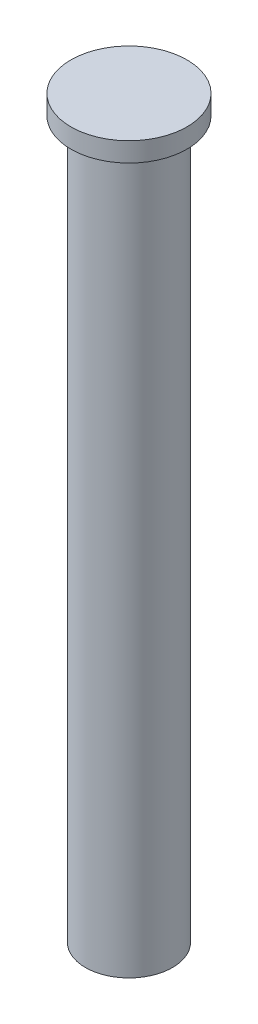
ISO-10303-21;
HEADER;
FILE_DESCRIPTION(('STEP AP214'),'2;1');
FILE_NAME('part.step','',(''),(''),'','','');
FILE_SCHEMA(('AUTOMOTIVE_DESIGN { 1 0 10303 214 1 1 1 1 }'));
ENDSEC;
DATA;
#1=APPLICATION_CONTEXT('core data for automotive mechanical design processes');
#2=APPLICATION_PROTOCOL_DEFINITION('international standard','automotive_design',2000,#1);
#3=PRODUCT_CONTEXT('',#1,'mechanical');
#4=PRODUCT('Part','Part','',(#3));
#5=PRODUCT_RELATED_PRODUCT_CATEGORY('part','',(#4));
#6=PRODUCT_DEFINITION_FORMATION('','',#4);
#7=PRODUCT_DEFINITION_CONTEXT('part definition',#1,'design');
#8=PRODUCT_DEFINITION('design','',#6,#7);
#9=PRODUCT_DEFINITION_SHAPE('','',#8);
#10=(LENGTH_UNIT() NAMED_UNIT(*) SI_UNIT(.MILLI.,.METRE.));
#11=(NAMED_UNIT(*) PLANE_ANGLE_UNIT() SI_UNIT($,.RADIAN.));
#12=(NAMED_UNIT(*) SI_UNIT($,.STERADIAN.) SOLID_ANGLE_UNIT());
#13=UNCERTAINTY_MEASURE_WITH_UNIT(LENGTH_MEASURE(1.E-05),#10,'distance_accuracy_value','');
#14=(GEOMETRIC_REPRESENTATION_CONTEXT(3) GLOBAL_UNCERTAINTY_ASSIGNED_CONTEXT((#13)) GLOBAL_UNIT_ASSIGNED_CONTEXT((#10,
#11,#12)) REPRESENTATION_CONTEXT('',''));
#15=CARTESIAN_POINT('',(0.,0.,0.));
#16=DIRECTION('',(0.,0.,1.));
#17=DIRECTION('',(1.,0.,0.));
#18=AXIS2_PLACEMENT_3D('',#15,#16,#17);
#19=CARTESIAN_POINT('',(0.,90.,0.));
#20=DIRECTION('',(0.,1.,0.));
#21=DIRECTION('',(-1.,0.,0.));
#22=AXIS2_PLACEMENT_3D('',#19,#20,#21);
#23=PLANE('',#22);
#24=CARTESIAN_POINT('',(0.,90.,0.));
#25=DIRECTION('',(0.,1.,0.));
#26=DIRECTION('',(-1.,0.,0.));
#27=AXIS2_PLACEMENT_3D('',#24,#25,#26);
#28=CIRCLE('',#27,30.);
#29=CARTESIAN_POINT('',(-30.,90.,0.));
#30=VERTEX_POINT('',#29);
#31=EDGE_CURVE('E56',#30,#30,#28,.T.);
#32=ORIENTED_EDGE('',*,*,#31,.T.);
#33=EDGE_LOOP('',(#32));
#34=FACE_BOUND('',#33,.T.);
#35=ADVANCED_FACE('F42',(#34),#23,.T.);
#36=CARTESIAN_POINT('',(22.5,-290.,0.));
#37=DIRECTION('',(0.,-1.,0.));
#38=DIRECTION('',(1.,0.,0.));
#39=AXIS2_PLACEMENT_3D('',#36,#37,#38);
#40=PLANE('',#39);
#41=CARTESIAN_POINT('',(0.,-290.,0.));
#42=DIRECTION('',(0.,1.,0.));
#43=DIRECTION('',(-1.,0.,0.));
#44=AXIS2_PLACEMENT_3D('',#41,#42,#43);
#45=CIRCLE('',#44,22.5);
#46=CARTESIAN_POINT('',(-22.5,-290.,0.));
#47=VERTEX_POINT('',#46);
#48=EDGE_CURVE('E10',#47,#47,#45,.T.);
#49=ORIENTED_EDGE('',*,*,#48,.F.);
#50=EDGE_LOOP('',(#49));
#51=FACE_BOUND('',#50,.T.);
#52=ADVANCED_FACE('F78',(#51),#40,.T.);
#53=CARTESIAN_POINT('',(0.,90.,0.));
#54=DIRECTION('',(0.,1.,0.));
#55=DIRECTION('',(-1.,0.,0.));
#56=AXIS2_PLACEMENT_3D('',#53,#54,#55);
#57=CYLINDRICAL_SURFACE('',#56,22.5);
#58=CARTESIAN_POINT('',(0.,80.,0.));
#59=DIRECTION('',(0.,1.,0.));
#60=DIRECTION('',(-1.,0.,0.));
#61=AXIS2_PLACEMENT_3D('',#58,#59,#60);
#62=CIRCLE('',#61,22.5);
#63=CARTESIAN_POINT('',(-22.5,80.,0.));
#64=VERTEX_POINT('',#63);
#65=EDGE_CURVE('E48',#64,#64,#62,.T.);
#66=ORIENTED_EDGE('',*,*,#65,.F.);
#67=EDGE_LOOP('',(#66));
#68=FACE_BOUND('',#67,.T.);
#69=ORIENTED_EDGE('',*,*,#48,.T.);
#70=EDGE_LOOP('',(#69));
#71=FACE_BOUND('',#70,.T.);
#72=ADVANCED_FACE('F73',(#68,#71),#57,.T.);
#73=CARTESIAN_POINT('',(30.,80.,0.));
#74=DIRECTION('',(0.,-1.,0.));
#75=DIRECTION('',(1.,0.,0.));
#76=AXIS2_PLACEMENT_3D('',#73,#74,#75);
#77=PLANE('',#76);
#78=ORIENTED_EDGE('',*,*,#65,.T.);
#79=EDGE_LOOP('',(#78));
#80=FACE_BOUND('',#79,.T.);
#81=CARTESIAN_POINT('',(0.,80.,0.));
#82=DIRECTION('',(0.,1.,0.));
#83=DIRECTION('',(-1.,0.,0.));
#84=AXIS2_PLACEMENT_3D('',#81,#82,#83);
#85=CIRCLE('',#84,30.);
#86=CARTESIAN_POINT('',(-30.,80.,0.));
#87=VERTEX_POINT('',#86);
#88=EDGE_CURVE('E52',#87,#87,#85,.T.);
#89=ORIENTED_EDGE('',*,*,#88,.F.);
#90=EDGE_LOOP('',(#89));
#91=FACE_BOUND('',#90,.T.);
#92=ADVANCED_FACE('F68',(#80,#91),#77,.T.);
#93=CARTESIAN_POINT('',(0.,90.,0.));
#94=DIRECTION('',(0.,1.,0.));
#95=DIRECTION('',(-1.,0.,0.));
#96=AXIS2_PLACEMENT_3D('',#93,#94,#95);
#97=CYLINDRICAL_SURFACE('',#96,30.);
#98=ORIENTED_EDGE('',*,*,#31,.F.);
#99=EDGE_LOOP('',(#98));
#100=FACE_BOUND('',#99,.T.);
#101=ORIENTED_EDGE('',*,*,#88,.T.);
#102=EDGE_LOOP('',(#101));
#103=FACE_BOUND('',#102,.T.);
#104=ADVANCED_FACE('F65',(#100,#103),#97,.T.);
#105=CLOSED_SHELL('',(#35,#52,#72,#92,#104));
#106=MANIFOLD_SOLID_BREP('B2',#105);
#107=ADVANCED_BREP_SHAPE_REPRESENTATION('',(#18,#106),#14);
#108=SHAPE_DEFINITION_REPRESENTATION(#9,#107);
ENDSEC;
END-ISO-10303-21;
